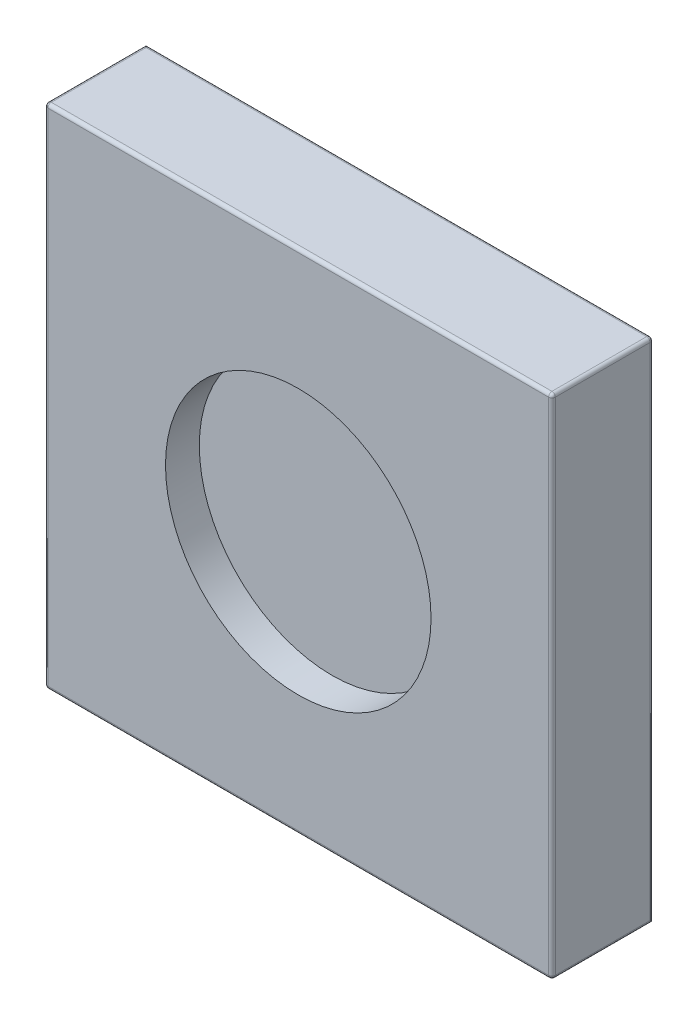
ISO-10303-21;
HEADER;
FILE_DESCRIPTION(('STEP AP214'),'2;1');
FILE_NAME('part.step','',(''),(''),'','','');
FILE_SCHEMA(('AUTOMOTIVE_DESIGN { 1 0 10303 214 1 1 1 1 }'));
ENDSEC;
DATA;
#1=APPLICATION_CONTEXT('core data for automotive mechanical design processes');
#2=APPLICATION_PROTOCOL_DEFINITION('international standard','automotive_design',2000,#1);
#3=PRODUCT_CONTEXT('',#1,'mechanical');
#4=PRODUCT('Part','Part','',(#3));
#5=PRODUCT_RELATED_PRODUCT_CATEGORY('part','',(#4));
#6=PRODUCT_DEFINITION_FORMATION('','',#4);
#7=PRODUCT_DEFINITION_CONTEXT('part definition',#1,'design');
#8=PRODUCT_DEFINITION('design','',#6,#7);
#9=PRODUCT_DEFINITION_SHAPE('','',#8);
#10=(LENGTH_UNIT() NAMED_UNIT(*) SI_UNIT(.MILLI.,.METRE.));
#11=(NAMED_UNIT(*) PLANE_ANGLE_UNIT() SI_UNIT($,.RADIAN.));
#12=(NAMED_UNIT(*) SI_UNIT($,.STERADIAN.) SOLID_ANGLE_UNIT());
#13=UNCERTAINTY_MEASURE_WITH_UNIT(LENGTH_MEASURE(1.E-05),#10,'distance_accuracy_value','');
#14=(GEOMETRIC_REPRESENTATION_CONTEXT(3) GLOBAL_UNCERTAINTY_ASSIGNED_CONTEXT((#13)) GLOBAL_UNIT_ASSIGNED_CONTEXT((#10,
#11,#12)) REPRESENTATION_CONTEXT('',''));
#15=CARTESIAN_POINT('',(0.,0.,0.));
#16=DIRECTION('',(0.,0.,1.));
#17=DIRECTION('',(1.,0.,0.));
#18=AXIS2_PLACEMENT_3D('',#15,#16,#17);
#19=CARTESIAN_POINT('',(-75.,-75.,-30.));
#20=DIRECTION('',(0.,-1.,0.));
#21=DIRECTION('',(0.,0.,-1.));
#22=AXIS2_PLACEMENT_3D('',#19,#20,#21);
#23=PLANE('',#22);
#24=DIRECTION('',(1.,0.,0.));
#25=VECTOR('',#24,1.);
#26=CARTESIAN_POINT('',(-75.,-75.,-30.));
#27=LINE('',#26,#25);
#28=CARTESIAN_POINT('',(-74.,-75.,-30.));
#29=VERTEX_POINT('',#28);
#30=CARTESIAN_POINT('',(74.,-75.,-30.));
#31=VERTEX_POINT('',#30);
#32=EDGE_CURVE('E125',#29,#31,#27,.T.);
#33=ORIENTED_EDGE('',*,*,#32,.T.);
#34=DIRECTION('',(0.,0.,1.));
#35=VECTOR('',#34,1.);
#36=CARTESIAN_POINT('',(74.,-75.,-30.));
#37=LINE('',#36,#35);
#38=CARTESIAN_POINT('',(74.,-75.,-1.));
#39=VERTEX_POINT('',#38);
#40=EDGE_CURVE('E133',#31,#39,#37,.T.);
#41=ORIENTED_EDGE('',*,*,#40,.T.);
#42=DIRECTION('',(1.,0.,0.));
#43=VECTOR('',#42,1.);
#44=CARTESIAN_POINT('',(-75.,-75.,-1.));
#45=LINE('',#44,#43);
#46=CARTESIAN_POINT('',(-74.,-75.,-1.));
#47=VERTEX_POINT('',#46);
#48=EDGE_CURVE('E128',#39,#47,#45,.F.);
#49=ORIENTED_EDGE('',*,*,#48,.T.);
#50=DIRECTION('',(0.,0.,1.));
#51=VECTOR('',#50,1.);
#52=CARTESIAN_POINT('',(-74.,-75.,-30.));
#53=LINE('',#52,#51);
#54=EDGE_CURVE('E122',#47,#29,#53,.F.);
#55=ORIENTED_EDGE('',*,*,#54,.T.);
#56=EDGE_LOOP('',(#33,#41,#49,#55));
#57=FACE_BOUND('',#56,.T.);
#58=ADVANCED_FACE('F39',(#57),#23,.T.);
#59=CARTESIAN_POINT('',(-75.,-75.,-30.));
#60=DIRECTION('',(1.,0.,0.));
#61=DIRECTION('',(0.,0.,-1.));
#62=AXIS2_PLACEMENT_3D('',#59,#60,#61);
#63=PLANE('',#62);
#64=DIRECTION('',(0.,1.,0.));
#65=VECTOR('',#64,1.);
#66=CARTESIAN_POINT('',(-75.,-75.,-30.));
#67=LINE('',#66,#65);
#68=CARTESIAN_POINT('',(-75.,-74.,-30.));
#69=VERTEX_POINT('',#68);
#70=CARTESIAN_POINT('',(-75.,74.,-30.));
#71=VERTEX_POINT('',#70);
#72=EDGE_CURVE('E142',#69,#71,#67,.T.);
#73=ORIENTED_EDGE('',*,*,#72,.F.);
#74=DIRECTION('',(0.,0.,1.));
#75=VECTOR('',#74,1.);
#76=CARTESIAN_POINT('',(-75.,-74.,0.));
#77=LINE('',#76,#75);
#78=CARTESIAN_POINT('',(-75.,-74.,-1.));
#79=VERTEX_POINT('',#78);
#80=EDGE_CURVE('E146',#69,#79,#77,.T.);
#81=ORIENTED_EDGE('',*,*,#80,.T.);
#82=DIRECTION('',(0.,1.,0.));
#83=VECTOR('',#82,1.);
#84=CARTESIAN_POINT('',(-75.,75.,-1.));
#85=LINE('',#84,#83);
#86=CARTESIAN_POINT('',(-75.,74.,-1.));
#87=VERTEX_POINT('',#86);
#88=EDGE_CURVE('E256',#79,#87,#85,.T.);
#89=ORIENTED_EDGE('',*,*,#88,.T.);
#90=DIRECTION('',(0.,0.,1.));
#91=VECTOR('',#90,1.);
#92=CARTESIAN_POINT('',(-75.,74.,-30.));
#93=LINE('',#92,#91);
#94=EDGE_CURVE('E217',#87,#71,#93,.F.);
#95=ORIENTED_EDGE('',*,*,#94,.T.);
#96=EDGE_LOOP('',(#73,#81,#89,#95));
#97=FACE_BOUND('',#96,.T.);
#98=ADVANCED_FACE('F287',(#97),#63,.F.);
#99=CARTESIAN_POINT('',(-75.,75.,-30.));
#100=DIRECTION('',(0.,-1.,0.));
#101=DIRECTION('',(0.,0.,-1.));
#102=AXIS2_PLACEMENT_3D('',#99,#100,#101);
#103=PLANE('',#102);
#104=DIRECTION('',(1.,0.,0.));
#105=VECTOR('',#104,1.);
#106=CARTESIAN_POINT('',(-75.,75.,-29.));
#107=LINE('',#106,#105);
#108=CARTESIAN_POINT('',(74.,75.,-29.));
#109=VERTEX_POINT('',#108);
#110=CARTESIAN_POINT('',(-74.,75.,-29.));
#111=VERTEX_POINT('',#110);
#112=EDGE_CURVE('E156',#109,#111,#107,.F.);
#113=ORIENTED_EDGE('',*,*,#112,.T.);
#114=DIRECTION('',(0.,0.,1.));
#115=VECTOR('',#114,1.);
#116=CARTESIAN_POINT('',(-74.,75.,-30.));
#117=LINE('',#116,#115);
#118=CARTESIAN_POINT('',(-74.,75.,-1.));
#119=VERTEX_POINT('',#118);
#120=EDGE_CURVE('E158',#111,#119,#117,.T.);
#121=ORIENTED_EDGE('',*,*,#120,.T.);
#122=DIRECTION('',(1.,0.,0.));
#123=VECTOR('',#122,1.);
#124=CARTESIAN_POINT('',(75.,75.,-1.));
#125=LINE('',#124,#123);
#126=CARTESIAN_POINT('',(74.,75.,-1.));
#127=VERTEX_POINT('',#126);
#128=EDGE_CURVE('E147',#119,#127,#125,.T.);
#129=ORIENTED_EDGE('',*,*,#128,.T.);
#130=DIRECTION('',(0.,0.,1.));
#131=VECTOR('',#130,1.);
#132=CARTESIAN_POINT('',(74.,75.,-30.));
#133=LINE('',#132,#131);
#134=EDGE_CURVE('E149',#127,#109,#133,.F.);
#135=ORIENTED_EDGE('',*,*,#134,.T.);
#136=EDGE_LOOP('',(#113,#121,#129,#135));
#137=FACE_BOUND('',#136,.T.);
#138=ADVANCED_FACE('F221',(#137),#103,.F.);
#139=CARTESIAN_POINT('',(75.,-75.,-30.));
#140=DIRECTION('',(1.,0.,0.));
#141=DIRECTION('',(0.,0.,-1.));
#142=AXIS2_PLACEMENT_3D('',#139,#140,#141);
#143=PLANE('',#142);
#144=DIRECTION('',(0.,1.,0.));
#145=VECTOR('',#144,1.);
#146=CARTESIAN_POINT('',(75.,-75.,-1.));
#147=LINE('',#146,#145);
#148=CARTESIAN_POINT('',(75.,74.,-1.));
#149=VERTEX_POINT('',#148);
#150=CARTESIAN_POINT('',(75.,-74.,-1.));
#151=VERTEX_POINT('',#150);
#152=EDGE_CURVE('E247',#149,#151,#147,.F.);
#153=ORIENTED_EDGE('',*,*,#152,.T.);
#154=DIRECTION('',(0.,0.,1.));
#155=VECTOR('',#154,1.);
#156=CARTESIAN_POINT('',(75.,-74.,-30.));
#157=LINE('',#156,#155);
#158=CARTESIAN_POINT('',(75.,-74.,-29.));
#159=VERTEX_POINT('',#158);
#160=EDGE_CURVE('E254',#151,#159,#157,.F.);
#161=ORIENTED_EDGE('',*,*,#160,.T.);
#162=DIRECTION('',(0.,1.,0.));
#163=VECTOR('',#162,1.);
#164=CARTESIAN_POINT('',(75.,75.,-29.));
#165=LINE('',#164,#163);
#166=CARTESIAN_POINT('',(75.,74.,-29.));
#167=VERTEX_POINT('',#166);
#168=EDGE_CURVE('E242',#159,#167,#165,.T.);
#169=ORIENTED_EDGE('',*,*,#168,.T.);
#170=DIRECTION('',(0.,0.,1.));
#171=VECTOR('',#170,1.);
#172=CARTESIAN_POINT('',(75.,74.,0.));
#173=LINE('',#172,#171);
#174=EDGE_CURVE('E235',#167,#149,#173,.T.);
#175=ORIENTED_EDGE('',*,*,#174,.T.);
#176=EDGE_LOOP('',(#153,#161,#169,#175));
#177=FACE_BOUND('',#176,.T.);
#178=ADVANCED_FACE('F283',(#177),#143,.T.);
#179=CARTESIAN_POINT('',(0.,0.,-30.));
#180=DIRECTION('',(0.,0.,1.));
#181=DIRECTION('',(1.,0.,0.));
#182=AXIS2_PLACEMENT_3D('',#179,#180,#181);
#183=PLANE('',#182);
#184=ORIENTED_EDGE('',*,*,#32,.F.);
#185=CARTESIAN_POINT('',(-74.,-74.,-30.));
#186=DIRECTION('',(0.,0.,1.));
#187=DIRECTION('',(1.,0.,0.));
#188=AXIS2_PLACEMENT_3D('',#185,#186,#187);
#189=CIRCLE('',#188,1.);
#190=EDGE_CURVE('E138',#29,#69,#189,.F.);
#191=ORIENTED_EDGE('',*,*,#190,.T.);
#192=ORIENTED_EDGE('',*,*,#72,.T.);
#193=DIRECTION('',(1.,0.,0.));
#194=VECTOR('',#193,1.);
#195=CARTESIAN_POINT('',(0.,74.,-30.));
#196=LINE('',#195,#194);
#197=CARTESIAN_POINT('',(74.,74.,-30.));
#198=VERTEX_POINT('',#197);
#199=EDGE_CURVE('E151',#71,#198,#196,.T.);
#200=ORIENTED_EDGE('',*,*,#199,.T.);
#201=DIRECTION('',(0.,1.,0.));
#202=VECTOR('',#201,1.);
#203=CARTESIAN_POINT('',(74.,-75.,-30.));
#204=LINE('',#203,#202);
#205=EDGE_CURVE('E141',#198,#31,#204,.F.);
#206=ORIENTED_EDGE('',*,*,#205,.T.);
#207=EDGE_LOOP('',(#184,#191,#192,#200,#206));
#208=FACE_BOUND('',#207,.T.);
#209=ADVANCED_FACE('F136',(#208),#183,.F.);
#210=CARTESIAN_POINT('',(0.,0.,0.));
#211=DIRECTION('',(0.,0.,1.));
#212=DIRECTION('',(1.,0.,0.));
#213=AXIS2_PLACEMENT_3D('',#210,#211,#212);
#214=PLANE('',#213);
#215=CARTESIAN_POINT('',(0.,0.,0.));
#216=DIRECTION('',(0.,0.,1.));
#217=DIRECTION('',(1.,0.,0.));
#218=AXIS2_PLACEMENT_3D('',#215,#216,#217);
#219=CIRCLE('',#218,39.25);
#220=CARTESIAN_POINT('',(39.25,0.,0.));
#221=VERTEX_POINT('',#220);
#222=EDGE_CURVE('E262',#221,#221,#219,.T.);
#223=ORIENTED_EDGE('',*,*,#222,.F.);
#224=EDGE_LOOP('',(#223));
#225=FACE_BOUND('',#224,.T.);
#226=DIRECTION('',(0.,1.,0.));
#227=VECTOR('',#226,1.);
#228=CARTESIAN_POINT('',(-74.,-75.,0.));
#229=LINE('',#228,#227);
#230=CARTESIAN_POINT('',(-74.,74.,0.));
#231=VERTEX_POINT('',#230);
#232=CARTESIAN_POINT('',(-74.,-74.,0.));
#233=VERTEX_POINT('',#232);
#234=EDGE_CURVE('E48',#231,#233,#229,.F.);
#235=ORIENTED_EDGE('',*,*,#234,.T.);
#236=DIRECTION('',(1.,0.,0.));
#237=VECTOR('',#236,1.);
#238=CARTESIAN_POINT('',(0.,-74.,0.));
#239=LINE('',#238,#237);
#240=CARTESIAN_POINT('',(74.,-74.,0.));
#241=VERTEX_POINT('',#240);
#242=EDGE_CURVE('E11',#233,#241,#239,.T.);
#243=ORIENTED_EDGE('',*,*,#242,.T.);
#244=DIRECTION('',(0.,1.,0.));
#245=VECTOR('',#244,1.);
#246=CARTESIAN_POINT('',(74.,0.,0.));
#247=LINE('',#246,#245);
#248=CARTESIAN_POINT('',(74.,74.,0.));
#249=VERTEX_POINT('',#248);
#250=EDGE_CURVE('E163',#241,#249,#247,.T.);
#251=ORIENTED_EDGE('',*,*,#250,.T.);
#252=DIRECTION('',(1.,0.,0.));
#253=VECTOR('',#252,1.);
#254=CARTESIAN_POINT('',(-75.,74.,0.));
#255=LINE('',#254,#253);
#256=EDGE_CURVE('E161',#249,#231,#255,.F.);
#257=ORIENTED_EDGE('',*,*,#256,.T.);
#258=EDGE_LOOP('',(#235,#243,#251,#257));
#259=FACE_BOUND('',#258,.T.);
#260=ADVANCED_FACE('F276',(#225,#259),#214,.T.);
#261=CARTESIAN_POINT('',(-74.,74.,-1.));
#262=DIRECTION('',(-1.,0.,0.));
#263=DIRECTION('',(0.,0.,1.));
#264=AXIS2_PLACEMENT_3D('',#261,#262,#263);
#265=SPHERICAL_SURFACE('',#264,1.);
#266=CARTESIAN_POINT('',(-74.,74.,-1.));
#267=DIRECTION('',(-1.,0.,0.));
#268=DIRECTION('',(0.,0.,1.));
#269=AXIS2_PLACEMENT_3D('',#266,#267,#268);
#270=CIRCLE('',#269,1.);
#271=EDGE_CURVE('E203',#119,#231,#270,.F.);
#272=ORIENTED_EDGE('',*,*,#271,.F.);
#273=CARTESIAN_POINT('',(-74.,74.,-1.));
#274=DIRECTION('',(0.,0.,1.));
#275=DIRECTION('',(1.,0.,0.));
#276=AXIS2_PLACEMENT_3D('',#273,#274,#275);
#277=CIRCLE('',#276,1.);
#278=EDGE_CURVE('E43',#87,#119,#277,.F.);
#279=ORIENTED_EDGE('',*,*,#278,.F.);
#280=CARTESIAN_POINT('',(-74.,74.,-1.));
#281=DIRECTION('',(0.,1.,0.));
#282=DIRECTION('',(0.,0.,1.));
#283=AXIS2_PLACEMENT_3D('',#280,#281,#282);
#284=CIRCLE('',#283,1.);
#285=EDGE_CURVE('E205',#231,#87,#284,.F.);
#286=ORIENTED_EDGE('',*,*,#285,.F.);
#287=EDGE_LOOP('',(#272,#279,#286));
#288=FACE_BOUND('',#287,.T.);
#289=ADVANCED_FACE('F41',(#288),#265,.T.);
#290=CARTESIAN_POINT('',(-74.,74.,-30.));
#291=DIRECTION('',(0.,0.,1.));
#292=DIRECTION('',(1.,0.,0.));
#293=AXIS2_PLACEMENT_3D('',#290,#291,#292);
#294=CYLINDRICAL_SURFACE('',#293,1.);
#295=ORIENTED_EDGE('',*,*,#278,.T.);
#296=ORIENTED_EDGE('',*,*,#120,.F.);
#297=CARTESIAN_POINT('',(-74.,74.,-29.));
#298=DIRECTION('',(0.707106781186547,0.,-0.707106781186547));
#299=DIRECTION('',(0.707106781186547,0.,0.707106781186547));
#300=AXIS2_PLACEMENT_3D('',#297,#298,#299);
#301=ELLIPSE('',#300,1.41421356237309,1.);
#302=EDGE_CURVE('E200',#71,#111,#301,.T.);
#303=ORIENTED_EDGE('',*,*,#302,.F.);
#304=ORIENTED_EDGE('',*,*,#94,.F.);
#305=EDGE_LOOP('',(#295,#296,#303,#304));
#306=FACE_BOUND('',#305,.T.);
#307=ADVANCED_FACE('F215',(#306),#294,.T.);
#308=CARTESIAN_POINT('',(-74.,-74.,-30.));
#309=DIRECTION('',(0.,0.,-1.));
#310=DIRECTION('',(-1.,0.,0.));
#311=AXIS2_PLACEMENT_3D('',#308,#309,#310);
#312=CYLINDRICAL_SURFACE('',#311,1.);
#313=ORIENTED_EDGE('',*,*,#190,.F.);
#314=ORIENTED_EDGE('',*,*,#54,.F.);
#315=CARTESIAN_POINT('',(-74.,-74.,-1.));
#316=DIRECTION('',(0.,0.,1.));
#317=DIRECTION('',(0.,-1.,0.));
#318=AXIS2_PLACEMENT_3D('',#315,#316,#317);
#319=CIRCLE('',#318,1.);
#320=EDGE_CURVE('E198',#79,#47,#319,.T.);
#321=ORIENTED_EDGE('',*,*,#320,.F.);
#322=ORIENTED_EDGE('',*,*,#80,.F.);
#323=EDGE_LOOP('',(#313,#314,#321,#322));
#324=FACE_BOUND('',#323,.T.);
#325=ADVANCED_FACE('F145',(#324),#312,.T.);
#326=CARTESIAN_POINT('',(-74.,-75.,-1.));
#327=DIRECTION('',(0.,-1.,0.));
#328=DIRECTION('',(0.,0.,-1.));
#329=AXIS2_PLACEMENT_3D('',#326,#327,#328);
#330=CYLINDRICAL_SURFACE('',#329,1.);
#331=ORIENTED_EDGE('',*,*,#285,.T.);
#332=ORIENTED_EDGE('',*,*,#88,.F.);
#333=CARTESIAN_POINT('',(-74.,-74.,-1.));
#334=DIRECTION('',(0.,-1.,0.));
#335=DIRECTION('',(0.,0.,-1.));
#336=AXIS2_PLACEMENT_3D('',#333,#334,#335);
#337=CIRCLE('',#336,1.);
#338=EDGE_CURVE('E195',#233,#79,#337,.T.);
#339=ORIENTED_EDGE('',*,*,#338,.F.);
#340=ORIENTED_EDGE('',*,*,#234,.F.);
#341=EDGE_LOOP('',(#331,#332,#339,#340));
#342=FACE_BOUND('',#341,.T.);
#343=ADVANCED_FACE('F327',(#342),#330,.T.);
#344=CARTESIAN_POINT('',(-75.,74.,-1.));
#345=DIRECTION('',(-1.,0.,0.));
#346=DIRECTION('',(0.,0.,1.));
#347=AXIS2_PLACEMENT_3D('',#344,#345,#346);
#348=CYLINDRICAL_SURFACE('',#347,1.);
#349=ORIENTED_EDGE('',*,*,#271,.T.);
#350=ORIENTED_EDGE('',*,*,#256,.F.);
#351=CARTESIAN_POINT('',(74.,74.,-1.));
#352=DIRECTION('',(1.,0.,0.));
#353=DIRECTION('',(0.,0.,-1.));
#354=AXIS2_PLACEMENT_3D('',#351,#352,#353);
#355=CIRCLE('',#354,1.);
#356=EDGE_CURVE('E192',#127,#249,#355,.T.);
#357=ORIENTED_EDGE('',*,*,#356,.F.);
#358=ORIENTED_EDGE('',*,*,#128,.F.);
#359=EDGE_LOOP('',(#349,#350,#357,#358));
#360=FACE_BOUND('',#359,.T.);
#361=ADVANCED_FACE('F324',(#360),#348,.T.);
#362=CARTESIAN_POINT('',(74.,74.,-30.));
#363=DIRECTION('',(0.,0.,-1.));
#364=DIRECTION('',(-1.,0.,0.));
#365=AXIS2_PLACEMENT_3D('',#362,#363,#364);
#366=CYLINDRICAL_SURFACE('',#365,1.);
#367=CARTESIAN_POINT('',(74.,74.,-29.));
#368=DIRECTION('',(0.,0.,-1.));
#369=DIRECTION('',(-1.,0.,0.));
#370=AXIS2_PLACEMENT_3D('',#367,#368,#369);
#371=CIRCLE('',#370,1.);
#372=EDGE_CURVE('E186',#109,#167,#371,.T.);
#373=ORIENTED_EDGE('',*,*,#372,.F.);
#374=ORIENTED_EDGE('',*,*,#134,.F.);
#375=CARTESIAN_POINT('',(74.,74.,-1.));
#376=DIRECTION('',(0.,0.,1.));
#377=DIRECTION('',(0.,-1.,0.));
#378=AXIS2_PLACEMENT_3D('',#375,#376,#377);
#379=CIRCLE('',#378,1.);
#380=EDGE_CURVE('E189',#149,#127,#379,.T.);
#381=ORIENTED_EDGE('',*,*,#380,.F.);
#382=ORIENTED_EDGE('',*,*,#174,.F.);
#383=EDGE_LOOP('',(#373,#374,#381,#382));
#384=FACE_BOUND('',#383,.T.);
#385=ADVANCED_FACE('F232',(#384),#366,.T.);
#386=CARTESIAN_POINT('',(0.,74.,-29.));
#387=DIRECTION('',(1.,0.,0.));
#388=DIRECTION('',(0.,0.,-1.));
#389=AXIS2_PLACEMENT_3D('',#386,#387,#388);
#390=CYLINDRICAL_SURFACE('',#389,1.);
#391=ORIENTED_EDGE('',*,*,#302,.T.);
#392=ORIENTED_EDGE('',*,*,#112,.F.);
#393=CARTESIAN_POINT('',(74.,74.,-29.));
#394=DIRECTION('',(1.,0.,0.));
#395=DIRECTION('',(0.,0.,-1.));
#396=AXIS2_PLACEMENT_3D('',#393,#394,#395);
#397=CIRCLE('',#396,1.);
#398=EDGE_CURVE('E183',#198,#109,#397,.T.);
#399=ORIENTED_EDGE('',*,*,#398,.F.);
#400=ORIENTED_EDGE('',*,*,#199,.F.);
#401=EDGE_LOOP('',(#391,#392,#399,#400));
#402=FACE_BOUND('',#401,.T.);
#403=ADVANCED_FACE('F227',(#402),#390,.T.);
#404=CARTESIAN_POINT('',(-74.,-74.,-1.));
#405=DIRECTION('',(-1.,0.,0.));
#406=DIRECTION('',(0.,0.,1.));
#407=AXIS2_PLACEMENT_3D('',#404,#405,#406);
#408=SPHERICAL_SURFACE('',#407,1.);
#409=ORIENTED_EDGE('',*,*,#338,.T.);
#410=ORIENTED_EDGE('',*,*,#320,.T.);
#411=CARTESIAN_POINT('',(-74.,-74.,-1.));
#412=DIRECTION('',(-1.,0.,0.));
#413=DIRECTION('',(0.,0.,1.));
#414=AXIS2_PLACEMENT_3D('',#411,#412,#413);
#415=CIRCLE('',#414,1.);
#416=EDGE_CURVE('E180',#233,#47,#415,.F.);
#417=ORIENTED_EDGE('',*,*,#416,.F.);
#418=EDGE_LOOP('',(#409,#410,#417));
#419=FACE_BOUND('',#418,.T.);
#420=ADVANCED_FACE('F315',(#419),#408,.T.);
#421=CARTESIAN_POINT('',(74.,74.,-1.));
#422=DIRECTION('',(0.,1.,0.));
#423=DIRECTION('',(0.,0.,1.));
#424=AXIS2_PLACEMENT_3D('',#421,#422,#423);
#425=SPHERICAL_SURFACE('',#424,1.);
#426=ORIENTED_EDGE('',*,*,#380,.T.);
#427=ORIENTED_EDGE('',*,*,#356,.T.);
#428=CARTESIAN_POINT('',(74.,74.,-1.));
#429=DIRECTION('',(0.,1.,0.));
#430=DIRECTION('',(0.,0.,1.));
#431=AXIS2_PLACEMENT_3D('',#428,#429,#430);
#432=CIRCLE('',#431,1.);
#433=EDGE_CURVE('E177',#149,#249,#432,.F.);
#434=ORIENTED_EDGE('',*,*,#433,.F.);
#435=EDGE_LOOP('',(#426,#427,#434));
#436=FACE_BOUND('',#435,.T.);
#437=ADVANCED_FACE('F312',(#436),#425,.T.);
#438=CARTESIAN_POINT('',(74.,74.,-29.));
#439=DIRECTION('',(0.,1.,0.));
#440=DIRECTION('',(0.,0.,1.));
#441=AXIS2_PLACEMENT_3D('',#438,#439,#440);
#442=SPHERICAL_SURFACE('',#441,1.);
#443=ORIENTED_EDGE('',*,*,#398,.T.);
#444=ORIENTED_EDGE('',*,*,#372,.T.);
#445=CARTESIAN_POINT('',(74.,74.,-29.));
#446=DIRECTION('',(0.,1.,0.));
#447=DIRECTION('',(0.,0.,1.));
#448=AXIS2_PLACEMENT_3D('',#445,#446,#447);
#449=CIRCLE('',#448,1.);
#450=EDGE_CURVE('E174',#198,#167,#449,.F.);
#451=ORIENTED_EDGE('',*,*,#450,.F.);
#452=EDGE_LOOP('',(#443,#444,#451));
#453=FACE_BOUND('',#452,.T.);
#454=ADVANCED_FACE('F237',(#453),#442,.T.);
#455=CARTESIAN_POINT('',(0.,-74.,-1.));
#456=DIRECTION('',(1.,0.,0.));
#457=DIRECTION('',(0.,0.,-1.));
#458=AXIS2_PLACEMENT_3D('',#455,#456,#457);
#459=CYLINDRICAL_SURFACE('',#458,1.);
#460=ORIENTED_EDGE('',*,*,#416,.T.);
#461=ORIENTED_EDGE('',*,*,#48,.F.);
#462=CARTESIAN_POINT('',(74.,-74.,-1.));
#463=DIRECTION('',(1.,0.,0.));
#464=DIRECTION('',(0.,0.,-1.));
#465=AXIS2_PLACEMENT_3D('',#462,#463,#464);
#466=CIRCLE('',#465,1.);
#467=EDGE_CURVE('E172',#241,#39,#466,.T.);
#468=ORIENTED_EDGE('',*,*,#467,.F.);
#469=ORIENTED_EDGE('',*,*,#242,.F.);
#470=EDGE_LOOP('',(#460,#461,#468,#469));
#471=FACE_BOUND('',#470,.T.);
#472=ADVANCED_FACE('F305',(#471),#459,.T.);
#473=CARTESIAN_POINT('',(74.,0.,-1.));
#474=DIRECTION('',(0.,1.,0.));
#475=DIRECTION('',(0.,0.,1.));
#476=AXIS2_PLACEMENT_3D('',#473,#474,#475);
#477=CYLINDRICAL_SURFACE('',#476,1.);
#478=ORIENTED_EDGE('',*,*,#433,.T.);
#479=ORIENTED_EDGE('',*,*,#250,.F.);
#480=CARTESIAN_POINT('',(74.,-74.,-1.));
#481=DIRECTION('',(0.,-1.,0.));
#482=DIRECTION('',(0.,0.,-1.));
#483=AXIS2_PLACEMENT_3D('',#480,#481,#482);
#484=CIRCLE('',#483,1.);
#485=EDGE_CURVE('E62',#151,#241,#484,.T.);
#486=ORIENTED_EDGE('',*,*,#485,.F.);
#487=ORIENTED_EDGE('',*,*,#152,.F.);
#488=EDGE_LOOP('',(#478,#479,#486,#487));
#489=FACE_BOUND('',#488,.T.);
#490=ADVANCED_FACE('F302',(#489),#477,.T.);
#491=CARTESIAN_POINT('',(74.,-75.,-29.));
#492=DIRECTION('',(0.,-1.,0.));
#493=DIRECTION('',(0.,0.,-1.));
#494=AXIS2_PLACEMENT_3D('',#491,#492,#493);
#495=CYLINDRICAL_SURFACE('',#494,1.);
#496=ORIENTED_EDGE('',*,*,#450,.T.);
#497=ORIENTED_EDGE('',*,*,#168,.F.);
#498=CARTESIAN_POINT('',(74.,-74.,-29.));
#499=DIRECTION('',(0.,-0.707106781186547,0.707106781186547));
#500=DIRECTION('',(0.,-0.707106781186547,-0.707106781186547));
#501=AXIS2_PLACEMENT_3D('',#498,#499,#500);
#502=ELLIPSE('',#501,1.41421356237309,1.);
#503=EDGE_CURVE('E168',#31,#159,#502,.T.);
#504=ORIENTED_EDGE('',*,*,#503,.F.);
#505=ORIENTED_EDGE('',*,*,#205,.F.);
#506=EDGE_LOOP('',(#496,#497,#504,#505));
#507=FACE_BOUND('',#506,.T.);
#508=ADVANCED_FACE('F240',(#507),#495,.T.);
#509=CARTESIAN_POINT('',(74.,-74.,-1.));
#510=DIRECTION('',(0.,0.,1.));
#511=DIRECTION('',(1.,0.,0.));
#512=AXIS2_PLACEMENT_3D('',#509,#510,#511);
#513=SPHERICAL_SURFACE('',#512,1.);
#514=ORIENTED_EDGE('',*,*,#485,.T.);
#515=ORIENTED_EDGE('',*,*,#467,.T.);
#516=CARTESIAN_POINT('',(74.,-74.,-1.));
#517=DIRECTION('',(0.,0.,1.));
#518=DIRECTION('',(1.,0.,0.));
#519=AXIS2_PLACEMENT_3D('',#516,#517,#518);
#520=CIRCLE('',#519,1.);
#521=EDGE_CURVE('E166',#151,#39,#520,.F.);
#522=ORIENTED_EDGE('',*,*,#521,.F.);
#523=EDGE_LOOP('',(#514,#515,#522));
#524=FACE_BOUND('',#523,.T.);
#525=ADVANCED_FACE('F297',(#524),#513,.T.);
#526=CARTESIAN_POINT('',(74.,-74.,-30.));
#527=DIRECTION('',(0.,0.,1.));
#528=DIRECTION('',(1.,0.,0.));
#529=AXIS2_PLACEMENT_3D('',#526,#527,#528);
#530=CYLINDRICAL_SURFACE('',#529,1.);
#531=ORIENTED_EDGE('',*,*,#503,.T.);
#532=ORIENTED_EDGE('',*,*,#160,.F.);
#533=ORIENTED_EDGE('',*,*,#521,.T.);
#534=ORIENTED_EDGE('',*,*,#40,.F.);
#535=EDGE_LOOP('',(#531,#532,#533,#534));
#536=FACE_BOUND('',#535,.T.);
#537=ADVANCED_FACE('F246',(#536),#530,.T.);
#538=CARTESIAN_POINT('',(0.,0.,-10.));
#539=DIRECTION('',(0.,0.,1.));
#540=DIRECTION('',(1.,0.,0.));
#541=AXIS2_PLACEMENT_3D('',#538,#539,#540);
#542=CYLINDRICAL_SURFACE('',#541,39.25);
#543=CARTESIAN_POINT('',(0.,0.,-10.));
#544=DIRECTION('',(0.,0.,1.));
#545=DIRECTION('',(1.,0.,0.));
#546=AXIS2_PLACEMENT_3D('',#543,#544,#545);
#547=CIRCLE('',#546,39.25);
#548=CARTESIAN_POINT('',(39.25,0.,-10.));
#549=VERTEX_POINT('',#548);
#550=EDGE_CURVE('E169',#549,#549,#547,.T.);
#551=ORIENTED_EDGE('',*,*,#550,.F.);
#552=EDGE_LOOP('',(#551));
#553=FACE_BOUND('',#552,.T.);
#554=ORIENTED_EDGE('',*,*,#222,.T.);
#555=EDGE_LOOP('',(#554));
#556=FACE_BOUND('',#555,.T.);
#557=ADVANCED_FACE('F270',(#553,#556),#542,.F.);
#558=CARTESIAN_POINT('',(0.,0.,-10.));
#559=DIRECTION('',(0.,0.,1.));
#560=DIRECTION('',(1.,0.,0.));
#561=AXIS2_PLACEMENT_3D('',#558,#559,#560);
#562=PLANE('',#561);
#563=ORIENTED_EDGE('',*,*,#550,.T.);
#564=EDGE_LOOP('',(#563));
#565=FACE_BOUND('',#564,.T.);
#566=ADVANCED_FACE('F268',(#565),#562,.T.);
#567=CLOSED_SHELL('',(#58,#98,#138,#178,#209,#260,#289,#307,#325,#343,#361,#385,#403,#420,#437,
#454,#472,#490,#508,#525,#537,#557,#566));
#568=MANIFOLD_SOLID_BREP('B2',#567);
#569=ADVANCED_BREP_SHAPE_REPRESENTATION('',(#18,#568),#14);
#570=SHAPE_DEFINITION_REPRESENTATION(#9,#569);
ENDSEC;
END-ISO-10303-21;
